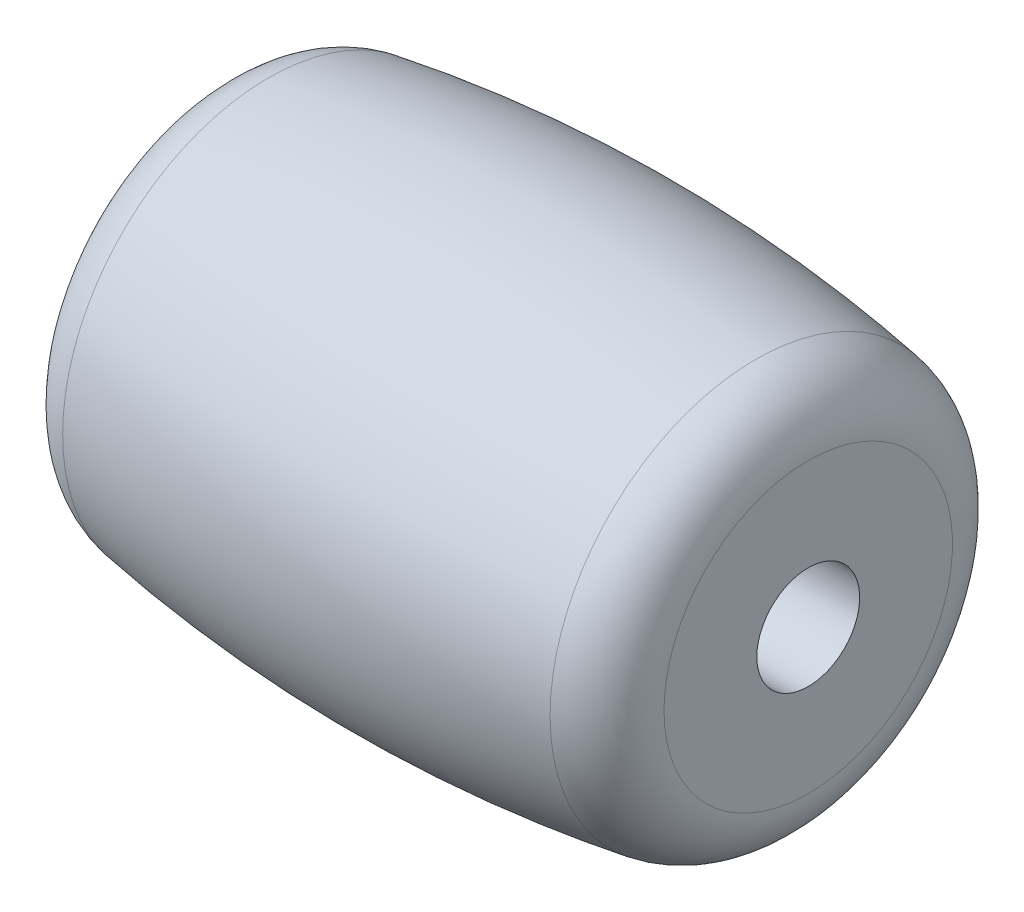
ISO-10303-21;
HEADER;
FILE_DESCRIPTION(('STEP AP214'),'2;1');
FILE_NAME('part.step','',(''),(''),'','','');
FILE_SCHEMA(('AUTOMOTIVE_DESIGN { 1 0 10303 214 1 1 1 1 }'));
ENDSEC;
DATA;
#1=APPLICATION_CONTEXT('core data for automotive mechanical design processes');
#2=APPLICATION_PROTOCOL_DEFINITION('international standard','automotive_design',2000,#1);
#3=PRODUCT_CONTEXT('',#1,'mechanical');
#4=PRODUCT('Part','Part','',(#3));
#5=PRODUCT_RELATED_PRODUCT_CATEGORY('part','',(#4));
#6=PRODUCT_DEFINITION_FORMATION('','',#4);
#7=PRODUCT_DEFINITION_CONTEXT('part definition',#1,'design');
#8=PRODUCT_DEFINITION('design','',#6,#7);
#9=PRODUCT_DEFINITION_SHAPE('','',#8);
#10=(LENGTH_UNIT() NAMED_UNIT(*) SI_UNIT(.MILLI.,.METRE.));
#11=(NAMED_UNIT(*) PLANE_ANGLE_UNIT() SI_UNIT($,.RADIAN.));
#12=(NAMED_UNIT(*) SI_UNIT($,.STERADIAN.) SOLID_ANGLE_UNIT());
#13=UNCERTAINTY_MEASURE_WITH_UNIT(LENGTH_MEASURE(1.E-05),#10,'distance_accuracy_value','');
#14=(GEOMETRIC_REPRESENTATION_CONTEXT(3) GLOBAL_UNCERTAINTY_ASSIGNED_CONTEXT((#13)) GLOBAL_UNIT_ASSIGNED_CONTEXT((#10,
#11,#12)) REPRESENTATION_CONTEXT('',''));
#15=CARTESIAN_POINT('',(0.,0.,0.));
#16=DIRECTION('',(0.,0.,1.));
#17=DIRECTION('',(1.,0.,0.));
#18=AXIS2_PLACEMENT_3D('',#15,#16,#17);
#19=CARTESIAN_POINT('',(7.5,0.,0.));
#20=DIRECTION('',(-1.,0.,0.));
#21=DIRECTION('',(0.,0.,1.));
#22=AXIS2_PLACEMENT_3D('',#19,#20,#21);
#23=TOROIDAL_SURFACE('',#22,4.627561796352,2.00000000000046);
#24=CARTESIAN_POINT('',(9.5,0.,0.));
#25=DIRECTION('',(-1.,0.,0.));
#26=DIRECTION('',(0.,0.,1.));
#27=AXIS2_PLACEMENT_3D('',#24,#25,#26);
#28=CIRCLE('',#27,4.627561796352);
#29=CARTESIAN_POINT('',(9.5,0.,4.627561796352));
#30=VERTEX_POINT('',#29);
#31=EDGE_CURVE('E12',#30,#30,#28,.T.);
#32=ORIENTED_EDGE('',*,*,#31,.T.);
#33=EDGE_LOOP('',(#32));
#34=FACE_BOUND('',#33,.T.);
#35=CARTESIAN_POINT('',(7.81924059641901,0.,0.));
#36=DIRECTION('',(-1.,0.,0.));
#37=DIRECTION('',(0.,0.,1.));
#38=AXIS2_PLACEMENT_3D('',#35,#36,#37);
#39=CIRCLE('',#38,6.60191876549436);
#40=CARTESIAN_POINT('',(7.81924059641901,0.,6.60191876549436));
#41=VERTEX_POINT('',#40);
#42=EDGE_CURVE('E62',#41,#41,#39,.T.);
#43=ORIENTED_EDGE('',*,*,#42,.F.);
#44=EDGE_LOOP('',(#43));
#45=FACE_BOUND('',#44,.T.);
#46=ADVANCED_FACE('F40',(#34,#45),#23,.T.);
#47=CARTESIAN_POINT('',(9.5,4.627561796352,0.));
#48=DIRECTION('',(1.,0.,0.));
#49=DIRECTION('',(0.,0.,-1.));
#50=AXIS2_PLACEMENT_3D('',#47,#48,#49);
#51=PLANE('',#50);
#52=CARTESIAN_POINT('',(9.5,0.,0.));
#53=DIRECTION('',(-1.,0.,0.));
#54=DIRECTION('',(0.,0.,1.));
#55=AXIS2_PLACEMENT_3D('',#52,#53,#54);
#56=CIRCLE('',#55,1.65);
#57=CARTESIAN_POINT('',(9.5,0.,1.65));
#58=VERTEX_POINT('',#57);
#59=EDGE_CURVE('E46',#58,#58,#56,.T.);
#60=ORIENTED_EDGE('',*,*,#59,.T.);
#61=EDGE_LOOP('',(#60));
#62=FACE_BOUND('',#61,.T.);
#63=ORIENTED_EDGE('',*,*,#31,.F.);
#64=EDGE_LOOP('',(#63));
#65=FACE_BOUND('',#64,.T.);
#66=ADVANCED_FACE('F70',(#62,#65),#51,.T.);
#67=CARTESIAN_POINT('',(9.50308908178157,0.,0.));
#68=DIRECTION('',(-1.,0.,0.));
#69=DIRECTION('',(0.,0.,1.));
#70=AXIS2_PLACEMENT_3D('',#67,#68,#69);
#71=CYLINDRICAL_SURFACE('',#70,1.65);
#72=CARTESIAN_POINT('',(-9.5,0.,0.));
#73=DIRECTION('',(-1.,0.,0.));
#74=DIRECTION('',(0.,0.,1.));
#75=AXIS2_PLACEMENT_3D('',#72,#73,#74);
#76=CIRCLE('',#75,1.65);
#77=CARTESIAN_POINT('',(-9.5,0.,1.65));
#78=VERTEX_POINT('',#77);
#79=EDGE_CURVE('E50',#78,#78,#76,.T.);
#80=ORIENTED_EDGE('',*,*,#79,.T.);
#81=EDGE_LOOP('',(#80));
#82=FACE_BOUND('',#81,.T.);
#83=ORIENTED_EDGE('',*,*,#59,.F.);
#84=EDGE_LOOP('',(#83));
#85=FACE_BOUND('',#84,.T.);
#86=ADVANCED_FACE('F74',(#82,#85),#71,.F.);
#87=CARTESIAN_POINT('',(-9.5,1.65,0.));
#88=DIRECTION('',(-1.,0.,0.));
#89=DIRECTION('',(0.,0.,1.));
#90=AXIS2_PLACEMENT_3D('',#87,#88,#89);
#91=PLANE('',#90);
#92=CARTESIAN_POINT('',(-9.5,0.,0.));
#93=DIRECTION('',(-1.,0.,0.));
#94=DIRECTION('',(0.,0.,1.));
#95=AXIS2_PLACEMENT_3D('',#92,#93,#94);
#96=CIRCLE('',#95,4.627561796352);
#97=CARTESIAN_POINT('',(-9.5,0.,4.627561796352));
#98=VERTEX_POINT('',#97);
#99=EDGE_CURVE('E54',#98,#98,#96,.T.);
#100=ORIENTED_EDGE('',*,*,#99,.T.);
#101=EDGE_LOOP('',(#100));
#102=FACE_BOUND('',#101,.T.);
#103=ORIENTED_EDGE('',*,*,#79,.F.);
#104=EDGE_LOOP('',(#103));
#105=FACE_BOUND('',#104,.T.);
#106=ADVANCED_FACE('F78',(#102,#105),#91,.T.);
#107=CARTESIAN_POINT('',(-7.5,0.,0.));
#108=DIRECTION('',(-1.,0.,0.));
#109=DIRECTION('',(0.,0.,1.));
#110=AXIS2_PLACEMENT_3D('',#107,#108,#109);
#111=TOROIDAL_SURFACE('',#110,4.627561796352,2.00000000000028);
#112=CARTESIAN_POINT('',(-7.81924059641899,0.,0.));
#113=DIRECTION('',(-1.,0.,0.));
#114=DIRECTION('',(0.,0.,1.));
#115=AXIS2_PLACEMENT_3D('',#112,#113,#114);
#116=CIRCLE('',#115,6.6019187654939);
#117=CARTESIAN_POINT('',(-7.81924059641899,0.,6.6019187654939));
#118=VERTEX_POINT('',#117);
#119=EDGE_CURVE('E59',#118,#118,#116,.T.);
#120=ORIENTED_EDGE('',*,*,#119,.T.);
#121=EDGE_LOOP('',(#120));
#122=FACE_BOUND('',#121,.T.);
#123=ORIENTED_EDGE('',*,*,#99,.F.);
#124=EDGE_LOOP('',(#123));
#125=FACE_BOUND('',#124,.T.);
#126=ADVANCED_FACE('F85',(#122,#125),#111,.T.);
#127=CARTESIAN_POINT('',(0.,0.,0.));
#128=DIRECTION('',(-1.,0.,0.));
#129=DIRECTION('',(0.,0.,1.));
#130=AXIS2_PLACEMENT_3D('',#127,#128,#129);
#131=DEGENERATE_TOROIDAL_SURFACE('',#130,41.7565053763542,48.9865053763545,.F.);
#132=ORIENTED_EDGE('',*,*,#42,.T.);
#133=EDGE_LOOP('',(#132));
#134=FACE_BOUND('',#133,.T.);
#135=ORIENTED_EDGE('',*,*,#119,.F.);
#136=EDGE_LOOP('',(#135));
#137=FACE_BOUND('',#136,.T.);
#138=ADVANCED_FACE('F66',(#134,#137),#131,.F.);
#139=CLOSED_SHELL('',(#46,#66,#86,#106,#126,#138));
#140=MANIFOLD_SOLID_BREP('B2',#139);
#141=ADVANCED_BREP_SHAPE_REPRESENTATION('',(#18,#140),#14);
#142=SHAPE_DEFINITION_REPRESENTATION(#9,#141);
ENDSEC;
END-ISO-10303-21;
